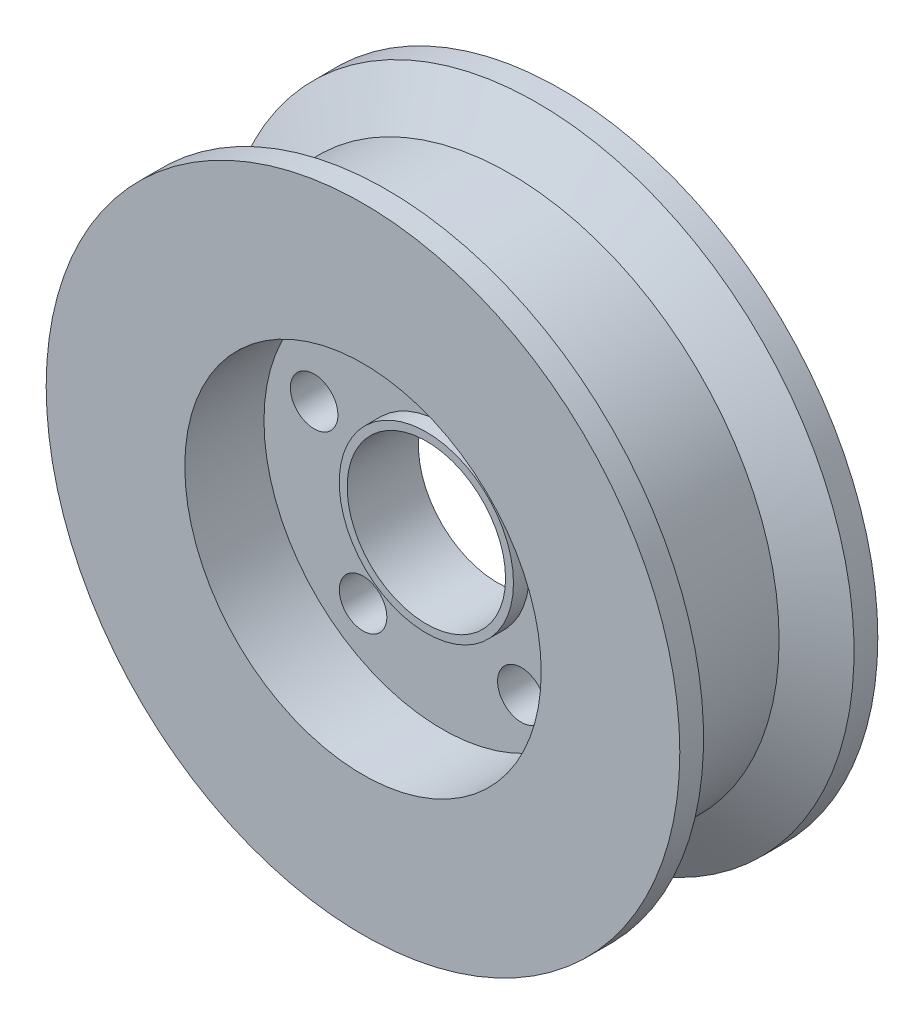
ISO-10303-21;
HEADER;
FILE_DESCRIPTION(('STEP AP214'),'2;1');
FILE_NAME('part.step','',(''),(''),'','','');
FILE_SCHEMA(('AUTOMOTIVE_DESIGN { 1 0 10303 214 1 1 1 1 }'));
ENDSEC;
DATA;
#1=APPLICATION_CONTEXT('core data for automotive mechanical design processes');
#2=APPLICATION_PROTOCOL_DEFINITION('international standard','automotive_design',2000,#1);
#3=PRODUCT_CONTEXT('',#1,'mechanical');
#4=PRODUCT('Part','Part','',(#3));
#5=PRODUCT_RELATED_PRODUCT_CATEGORY('part','',(#4));
#6=PRODUCT_DEFINITION_FORMATION('','',#4);
#7=PRODUCT_DEFINITION_CONTEXT('part definition',#1,'design');
#8=PRODUCT_DEFINITION('design','',#6,#7);
#9=PRODUCT_DEFINITION_SHAPE('','',#8);
#10=(LENGTH_UNIT() NAMED_UNIT(*) SI_UNIT(.MILLI.,.METRE.));
#11=(NAMED_UNIT(*) PLANE_ANGLE_UNIT() SI_UNIT($,.RADIAN.));
#12=(NAMED_UNIT(*) SI_UNIT($,.STERADIAN.) SOLID_ANGLE_UNIT());
#13=UNCERTAINTY_MEASURE_WITH_UNIT(LENGTH_MEASURE(1.E-05),#10,'distance_accuracy_value','');
#14=(GEOMETRIC_REPRESENTATION_CONTEXT(3) GLOBAL_UNCERTAINTY_ASSIGNED_CONTEXT((#13)) GLOBAL_UNIT_ASSIGNED_CONTEXT((#10,
#11,#12)) REPRESENTATION_CONTEXT('',''));
#15=CARTESIAN_POINT('',(0.,0.,0.));
#16=DIRECTION('',(0.,0.,1.));
#17=DIRECTION('',(1.,0.,0.));
#18=AXIS2_PLACEMENT_3D('',#15,#16,#17);
#19=CARTESIAN_POINT('',(0.,0.,12.5));
#20=DIRECTION('',(0.,0.,-1.));
#21=DIRECTION('',(-1.,0.,0.));
#22=AXIS2_PLACEMENT_3D('',#19,#20,#21);
#23=CYLINDRICAL_SURFACE('',#22,40.);
#24=CARTESIAN_POINT('',(0.,0.,-9.5));
#25=DIRECTION('',(0.,0.,-1.));
#26=DIRECTION('',(-1.,0.,0.));
#27=AXIS2_PLACEMENT_3D('',#24,#25,#26);
#28=CIRCLE('',#27,40.);
#29=CARTESIAN_POINT('',(-40.,0.,-9.5));
#30=VERTEX_POINT('',#29);
#31=EDGE_CURVE('E202',#30,#30,#28,.T.);
#32=ORIENTED_EDGE('',*,*,#31,.T.);
#33=EDGE_LOOP('',(#32));
#34=FACE_BOUND('',#33,.T.);
#35=CARTESIAN_POINT('',(0.,0.,-12.5));
#36=DIRECTION('',(0.,0.,1.));
#37=DIRECTION('',(1.,0.,0.));
#38=AXIS2_PLACEMENT_3D('',#35,#36,#37);
#39=CIRCLE('',#38,40.);
#40=CARTESIAN_POINT('',(40.,0.,-12.5));
#41=VERTEX_POINT('',#40);
#42=EDGE_CURVE('E78',#41,#41,#39,.T.);
#43=ORIENTED_EDGE('',*,*,#42,.T.);
#44=EDGE_LOOP('',(#43));
#45=FACE_BOUND('',#44,.T.);
#46=ADVANCED_FACE('F31',(#34,#45),#23,.T.);
#47=CARTESIAN_POINT('',(0.,0.,-12.5));
#48=DIRECTION('',(0.,0.,1.));
#49=DIRECTION('',(1.,0.,0.));
#50=AXIS2_PLACEMENT_3D('',#47,#48,#49);
#51=PLANE('',#50);
#52=ORIENTED_EDGE('',*,*,#42,.F.);
#53=EDGE_LOOP('',(#52));
#54=FACE_BOUND('',#53,.T.);
#55=CARTESIAN_POINT('',(0.,0.,-12.5));
#56=DIRECTION('',(0.,0.,1.));
#57=DIRECTION('',(1.,0.,0.));
#58=AXIS2_PLACEMENT_3D('',#55,#56,#57);
#59=CIRCLE('',#58,22.5);
#60=CARTESIAN_POINT('',(22.5,0.,-12.5));
#61=VERTEX_POINT('',#60);
#62=EDGE_CURVE('E72',#61,#61,#59,.T.);
#63=ORIENTED_EDGE('',*,*,#62,.T.);
#64=EDGE_LOOP('',(#63));
#65=FACE_BOUND('',#64,.T.);
#66=ADVANCED_FACE('F121',(#54,#65),#51,.F.);
#67=CARTESIAN_POINT('',(0.,0.,12.5));
#68=DIRECTION('',(0.,0.,1.));
#69=DIRECTION('',(1.,0.,0.));
#70=AXIS2_PLACEMENT_3D('',#67,#68,#69);
#71=PLANE('',#70);
#72=CARTESIAN_POINT('',(0.,0.,12.5));
#73=DIRECTION('',(0.,0.,1.));
#74=DIRECTION('',(1.,0.,0.));
#75=AXIS2_PLACEMENT_3D('',#72,#73,#74);
#76=CIRCLE('',#75,22.5);
#77=CARTESIAN_POINT('',(22.5,0.,12.5));
#78=VERTEX_POINT('',#77);
#79=EDGE_CURVE('E71',#78,#78,#76,.T.);
#80=ORIENTED_EDGE('',*,*,#79,.F.);
#81=EDGE_LOOP('',(#80));
#82=FACE_BOUND('',#81,.T.);
#83=CARTESIAN_POINT('',(0.,0.,12.5));
#84=DIRECTION('',(0.,0.,1.));
#85=DIRECTION('',(1.,0.,0.));
#86=AXIS2_PLACEMENT_3D('',#83,#84,#85);
#87=CIRCLE('',#86,40.);
#88=CARTESIAN_POINT('',(40.,0.,12.5));
#89=VERTEX_POINT('',#88);
#90=EDGE_CURVE('E43',#89,#89,#87,.T.);
#91=ORIENTED_EDGE('',*,*,#90,.T.);
#92=EDGE_LOOP('',(#91));
#93=FACE_BOUND('',#92,.T.);
#94=ADVANCED_FACE('F123',(#82,#93),#71,.T.);
#95=CARTESIAN_POINT('',(0.,0.,9.5));
#96=DIRECTION('',(0.,0.,-1.));
#97=DIRECTION('',(-1.,0.,0.));
#98=AXIS2_PLACEMENT_3D('',#95,#96,#97);
#99=CIRCLE('',#98,40.);
#100=CARTESIAN_POINT('',(-40.,0.,9.5));
#101=VERTEX_POINT('',#100);
#102=EDGE_CURVE('E194',#101,#101,#99,.T.);
#103=ORIENTED_EDGE('',*,*,#102,.F.);
#104=EDGE_LOOP('',(#103));
#105=FACE_BOUND('',#104,.T.);
#106=ORIENTED_EDGE('',*,*,#90,.F.);
#107=EDGE_LOOP('',(#106));
#108=FACE_BOUND('',#107,.T.);
#109=ADVANCED_FACE('F33',(#105,#108),#23,.T.);
#110=CARTESIAN_POINT('',(0.,0.,2.5));
#111=DIRECTION('',(0.,0.,1.));
#112=DIRECTION('',(1.,0.,0.));
#113=AXIS2_PLACEMENT_3D('',#110,#111,#112);
#114=CYLINDRICAL_SURFACE('',#113,22.5);
#115=CARTESIAN_POINT('',(0.,0.,2.5));
#116=DIRECTION('',(0.,0.,1.));
#117=DIRECTION('',(1.,0.,0.));
#118=AXIS2_PLACEMENT_3D('',#115,#116,#117);
#119=CIRCLE('',#118,22.5);
#120=CARTESIAN_POINT('',(22.5,0.,2.5));
#121=VERTEX_POINT('',#120);
#122=EDGE_CURVE('E75',#121,#121,#119,.T.);
#123=ORIENTED_EDGE('',*,*,#122,.F.);
#124=EDGE_LOOP('',(#123));
#125=FACE_BOUND('',#124,.T.);
#126=ORIENTED_EDGE('',*,*,#79,.T.);
#127=EDGE_LOOP('',(#126));
#128=FACE_BOUND('',#127,.T.);
#129=ADVANCED_FACE('F140',(#125,#128),#114,.F.);
#130=CARTESIAN_POINT('',(0.,0.,2.5));
#131=DIRECTION('',(0.,0.,1.));
#132=DIRECTION('',(1.,0.,0.));
#133=AXIS2_PLACEMENT_3D('',#130,#131,#132);
#134=PLANE('',#133);
#135=CARTESIAN_POINT('',(0.,0.,2.5));
#136=DIRECTION('',(0.,0.,1.));
#137=DIRECTION('',(1.,0.,0.));
#138=AXIS2_PLACEMENT_3D('',#135,#136,#137);
#139=CIRCLE('',#138,11.);
#140=CARTESIAN_POINT('',(11.,0.,2.5));
#141=VERTEX_POINT('',#140);
#142=EDGE_CURVE('E10',#141,#141,#139,.T.);
#143=ORIENTED_EDGE('',*,*,#142,.F.);
#144=EDGE_LOOP('',(#143));
#145=FACE_BOUND('',#144,.T.);
#146=CARTESIAN_POINT('',(-16.1679607770176,5.25328890437429,2.5));
#147=DIRECTION('',(0.,0.,1.));
#148=DIRECTION('',(0.309016994374958,0.95105651629515,0.));
#149=AXIS2_PLACEMENT_3D('',#146,#147,#148);
#150=CIRCLE('',#149,3.);
#151=CARTESIAN_POINT('',(-15.2409097938927,8.10645845325974,2.5));
#152=VERTEX_POINT('',#151);
#153=EDGE_CURVE('E48',#152,#152,#150,.T.);
#154=ORIENTED_EDGE('',*,*,#153,.F.);
#155=EDGE_LOOP('',(#154));
#156=FACE_BOUND('',#155,.T.);
#157=CARTESIAN_POINT('',(-9.99234928897216,-13.753288904374,2.5));
#158=DIRECTION('',(0.,0.,1.));
#159=DIRECTION('',(-0.809016994374942,0.58778525229248,0.));
#160=AXIS2_PLACEMENT_3D('',#157,#158,#159);
#161=CIRCLE('',#160,3.);
#162=CARTESIAN_POINT('',(-12.419400272097,-11.9899331474966,2.5));
#163=VERTEX_POINT('',#162);
#164=EDGE_CURVE('E52',#163,#163,#161,.T.);
#165=ORIENTED_EDGE('',*,*,#164,.F.);
#166=EDGE_LOOP('',(#165));
#167=FACE_BOUND('',#166,.T.);
#168=CARTESIAN_POINT('',(9.99234928897197,-13.7532889043742,2.5));
#169=DIRECTION('',(0.,0.,1.));
#170=DIRECTION('',(-0.809016994374951,-0.587785252292469,0.));
#171=AXIS2_PLACEMENT_3D('',#168,#169,#170);
#172=CIRCLE('',#171,3.);
#173=CARTESIAN_POINT('',(7.56529830584712,-15.5166446612516,2.5));
#174=VERTEX_POINT('',#173);
#175=EDGE_CURVE('E56',#174,#174,#172,.T.);
#176=ORIENTED_EDGE('',*,*,#175,.F.);
#177=EDGE_LOOP('',(#176));
#178=FACE_BOUND('',#177,.T.);
#179=CARTESIAN_POINT('',(16.1679607770176,5.25328890437406,2.5));
#180=DIRECTION('',(0.,0.,1.));
#181=DIRECTION('',(0.309016994374945,-0.951056516295155,0.));
#182=AXIS2_PLACEMENT_3D('',#179,#180,#181);
#183=CIRCLE('',#182,3.);
#184=CARTESIAN_POINT('',(17.0950117601425,2.4001193554886,2.5));
#185=VERTEX_POINT('',#184);
#186=EDGE_CURVE('E60',#185,#185,#183,.T.);
#187=ORIENTED_EDGE('',*,*,#186,.F.);
#188=EDGE_LOOP('',(#187));
#189=FACE_BOUND('',#188,.T.);
#190=CARTESIAN_POINT('',(0.,17.,2.5));
#191=DIRECTION('',(0.,0.,1.));
#192=DIRECTION('',(1.,0.,0.));
#193=AXIS2_PLACEMENT_3D('',#190,#191,#192);
#194=CIRCLE('',#193,3.);
#195=CARTESIAN_POINT('',(3.,17.,2.5));
#196=VERTEX_POINT('',#195);
#197=EDGE_CURVE('E64',#196,#196,#194,.T.);
#198=ORIENTED_EDGE('',*,*,#197,.F.);
#199=EDGE_LOOP('',(#198));
#200=FACE_BOUND('',#199,.T.);
#201=ORIENTED_EDGE('',*,*,#122,.T.);
#202=EDGE_LOOP('',(#201));
#203=FACE_BOUND('',#202,.T.);
#204=ADVANCED_FACE('F117',(#145,#156,#167,#178,#189,#200,#203),#134,.T.);
#205=CARTESIAN_POINT('',(0.,0.,-2.5));
#206=DIRECTION('',(0.,0.,-1.));
#207=DIRECTION('',(-1.,0.,0.));
#208=AXIS2_PLACEMENT_3D('',#205,#206,#207);
#209=CYLINDRICAL_SURFACE('',#208,22.5);
#210=CARTESIAN_POINT('',(0.,0.,-2.5));
#211=DIRECTION('',(0.,0.,1.));
#212=DIRECTION('',(1.,0.,0.));
#213=AXIS2_PLACEMENT_3D('',#210,#211,#212);
#214=CIRCLE('',#213,22.5);
#215=CARTESIAN_POINT('',(22.5,0.,-2.5));
#216=VERTEX_POINT('',#215);
#217=EDGE_CURVE('E68',#216,#216,#214,.T.);
#218=ORIENTED_EDGE('',*,*,#217,.T.);
#219=EDGE_LOOP('',(#218));
#220=FACE_BOUND('',#219,.T.);
#221=ORIENTED_EDGE('',*,*,#62,.F.);
#222=EDGE_LOOP('',(#221));
#223=FACE_BOUND('',#222,.T.);
#224=ADVANCED_FACE('F102',(#220,#223),#209,.F.);
#225=CARTESIAN_POINT('',(0.,0.,-2.5));
#226=DIRECTION('',(0.,0.,-1.));
#227=DIRECTION('',(1.,0.,0.));
#228=AXIS2_PLACEMENT_3D('',#225,#226,#227);
#229=PLANE('',#228);
#230=CARTESIAN_POINT('',(0.,0.,-2.5));
#231=DIRECTION('',(0.,0.,-1.));
#232=DIRECTION('',(-1.,0.,0.));
#233=AXIS2_PLACEMENT_3D('',#230,#231,#232);
#234=CIRCLE('',#233,11.);
#235=CARTESIAN_POINT('',(-11.,0.,-2.5));
#236=VERTEX_POINT('',#235);
#237=EDGE_CURVE('E35',#236,#236,#234,.T.);
#238=ORIENTED_EDGE('',*,*,#237,.F.);
#239=EDGE_LOOP('',(#238));
#240=FACE_BOUND('',#239,.T.);
#241=CARTESIAN_POINT('',(-16.1679607770176,5.25328890437429,-2.5));
#242=DIRECTION('',(0.,0.,-1.));
#243=DIRECTION('',(-1.,0.,0.));
#244=AXIS2_PLACEMENT_3D('',#241,#242,#243);
#245=CIRCLE('',#244,3.);
#246=CARTESIAN_POINT('',(-19.1679607770176,5.25328890437429,-2.5));
#247=VERTEX_POINT('',#246);
#248=EDGE_CURVE('E51',#247,#247,#245,.T.);
#249=ORIENTED_EDGE('',*,*,#248,.F.);
#250=EDGE_LOOP('',(#249));
#251=FACE_BOUND('',#250,.T.);
#252=CARTESIAN_POINT('',(-9.99234928897216,-13.753288904374,-2.5));
#253=DIRECTION('',(0.,0.,-1.));
#254=DIRECTION('',(-1.,0.,0.));
#255=AXIS2_PLACEMENT_3D('',#252,#253,#254);
#256=CIRCLE('',#255,3.);
#257=CARTESIAN_POINT('',(-12.9923492889722,-13.753288904374,-2.5));
#258=VERTEX_POINT('',#257);
#259=EDGE_CURVE('E55',#258,#258,#256,.T.);
#260=ORIENTED_EDGE('',*,*,#259,.F.);
#261=EDGE_LOOP('',(#260));
#262=FACE_BOUND('',#261,.T.);
#263=CARTESIAN_POINT('',(9.99234928897197,-13.7532889043742,-2.5));
#264=DIRECTION('',(0.,0.,-1.));
#265=DIRECTION('',(-1.,0.,0.));
#266=AXIS2_PLACEMENT_3D('',#263,#264,#265);
#267=CIRCLE('',#266,3.);
#268=CARTESIAN_POINT('',(6.99234928897197,-13.7532889043742,-2.5));
#269=VERTEX_POINT('',#268);
#270=EDGE_CURVE('E59',#269,#269,#267,.T.);
#271=ORIENTED_EDGE('',*,*,#270,.F.);
#272=EDGE_LOOP('',(#271));
#273=FACE_BOUND('',#272,.T.);
#274=CARTESIAN_POINT('',(16.1679607770176,5.25328890437406,-2.5));
#275=DIRECTION('',(0.,0.,-1.));
#276=DIRECTION('',(-1.,0.,0.));
#277=AXIS2_PLACEMENT_3D('',#274,#275,#276);
#278=CIRCLE('',#277,3.);
#279=CARTESIAN_POINT('',(13.1679607770176,5.25328890437406,-2.5));
#280=VERTEX_POINT('',#279);
#281=EDGE_CURVE('E63',#280,#280,#278,.T.);
#282=ORIENTED_EDGE('',*,*,#281,.F.);
#283=EDGE_LOOP('',(#282));
#284=FACE_BOUND('',#283,.T.);
#285=CARTESIAN_POINT('',(0.,17.,-2.5));
#286=DIRECTION('',(0.,0.,-1.));
#287=DIRECTION('',(-1.,0.,0.));
#288=AXIS2_PLACEMENT_3D('',#285,#286,#287);
#289=CIRCLE('',#288,3.);
#290=CARTESIAN_POINT('',(-3.,17.,-2.5));
#291=VERTEX_POINT('',#290);
#292=EDGE_CURVE('E67',#291,#291,#289,.T.);
#293=ORIENTED_EDGE('',*,*,#292,.F.);
#294=EDGE_LOOP('',(#293));
#295=FACE_BOUND('',#294,.T.);
#296=ORIENTED_EDGE('',*,*,#217,.F.);
#297=EDGE_LOOP('',(#296));
#298=FACE_BOUND('',#297,.T.);
#299=ADVANCED_FACE('F98',(#240,#251,#262,#273,#284,#295,#298),#229,.T.);
#300=CARTESIAN_POINT('',(0.,17.,-12.5));
#301=DIRECTION('',(0.,0.,1.));
#302=DIRECTION('',(1.,0.,0.));
#303=AXIS2_PLACEMENT_3D('',#300,#301,#302);
#304=CYLINDRICAL_SURFACE('',#303,3.);
#305=ORIENTED_EDGE('',*,*,#292,.T.);
#306=EDGE_LOOP('',(#305));
#307=FACE_BOUND('',#306,.T.);
#308=ORIENTED_EDGE('',*,*,#197,.T.);
#309=EDGE_LOOP('',(#308));
#310=FACE_BOUND('',#309,.T.);
#311=ADVANCED_FACE('F101',(#307,#310),#304,.F.);
#312=CARTESIAN_POINT('',(16.1679607770176,5.25328890437406,-12.5));
#313=DIRECTION('',(0.,0.,1.));
#314=DIRECTION('',(1.,0.,0.));
#315=AXIS2_PLACEMENT_3D('',#312,#313,#314);
#316=CYLINDRICAL_SURFACE('',#315,3.);
#317=ORIENTED_EDGE('',*,*,#281,.T.);
#318=EDGE_LOOP('',(#317));
#319=FACE_BOUND('',#318,.T.);
#320=ORIENTED_EDGE('',*,*,#186,.T.);
#321=EDGE_LOOP('',(#320));
#322=FACE_BOUND('',#321,.T.);
#323=ADVANCED_FACE('F149',(#319,#322),#316,.F.);
#324=CARTESIAN_POINT('',(9.99234928897197,-13.7532889043742,-12.5));
#325=DIRECTION('',(0.,0.,1.));
#326=DIRECTION('',(1.,0.,0.));
#327=AXIS2_PLACEMENT_3D('',#324,#325,#326);
#328=CYLINDRICAL_SURFACE('',#327,3.);
#329=ORIENTED_EDGE('',*,*,#270,.T.);
#330=EDGE_LOOP('',(#329));
#331=FACE_BOUND('',#330,.T.);
#332=ORIENTED_EDGE('',*,*,#175,.T.);
#333=EDGE_LOOP('',(#332));
#334=FACE_BOUND('',#333,.T.);
#335=ADVANCED_FACE('F153',(#331,#334),#328,.F.);
#336=CARTESIAN_POINT('',(-9.99234928897216,-13.753288904374,-12.5));
#337=DIRECTION('',(0.,0.,1.));
#338=DIRECTION('',(1.,0.,0.));
#339=AXIS2_PLACEMENT_3D('',#336,#337,#338);
#340=CYLINDRICAL_SURFACE('',#339,3.);
#341=ORIENTED_EDGE('',*,*,#259,.T.);
#342=EDGE_LOOP('',(#341));
#343=FACE_BOUND('',#342,.T.);
#344=ORIENTED_EDGE('',*,*,#164,.T.);
#345=EDGE_LOOP('',(#344));
#346=FACE_BOUND('',#345,.T.);
#347=ADVANCED_FACE('F157',(#343,#346),#340,.F.);
#348=CARTESIAN_POINT('',(-16.1679607770176,5.25328890437429,-12.5));
#349=DIRECTION('',(0.,0.,1.));
#350=DIRECTION('',(1.,0.,0.));
#351=AXIS2_PLACEMENT_3D('',#348,#349,#350);
#352=CYLINDRICAL_SURFACE('',#351,3.);
#353=ORIENTED_EDGE('',*,*,#248,.T.);
#354=EDGE_LOOP('',(#353));
#355=FACE_BOUND('',#354,.T.);
#356=ORIENTED_EDGE('',*,*,#153,.T.);
#357=EDGE_LOOP('',(#356));
#358=FACE_BOUND('',#357,.T.);
#359=ADVANCED_FACE('F95',(#355,#358),#352,.F.);
#360=CARTESIAN_POINT('',(0.,0.,-4.5));
#361=DIRECTION('',(0.,0.,1.));
#362=DIRECTION('',(1.,0.,0.));
#363=AXIS2_PLACEMENT_3D('',#360,#361,#362);
#364=CYLINDRICAL_SURFACE('',#363,11.);
#365=ORIENTED_EDGE('',*,*,#237,.T.);
#366=EDGE_LOOP('',(#365));
#367=FACE_BOUND('',#366,.T.);
#368=CARTESIAN_POINT('',(0.,0.,-4.5));
#369=DIRECTION('',(0.,0.,1.));
#370=DIRECTION('',(1.,0.,0.));
#371=AXIS2_PLACEMENT_3D('',#368,#369,#370);
#372=CIRCLE('',#371,11.);
#373=CARTESIAN_POINT('',(11.,0.,-4.5));
#374=VERTEX_POINT('',#373);
#375=EDGE_CURVE('E46',#374,#374,#372,.T.);
#376=ORIENTED_EDGE('',*,*,#375,.T.);
#377=EDGE_LOOP('',(#376));
#378=FACE_BOUND('',#377,.T.);
#379=ADVANCED_FACE('F164',(#367,#378),#364,.T.);
#380=CARTESIAN_POINT('',(0.,0.,-4.5));
#381=DIRECTION('',(0.,0.,1.));
#382=DIRECTION('',(1.,0.,0.));
#383=AXIS2_PLACEMENT_3D('',#380,#381,#382);
#384=PLANE('',#383);
#385=CARTESIAN_POINT('',(0.,0.,-4.5));
#386=DIRECTION('',(0.,0.,1.));
#387=DIRECTION('',(1.,0.,0.));
#388=AXIS2_PLACEMENT_3D('',#385,#386,#387);
#389=CIRCLE('',#388,10.);
#390=CARTESIAN_POINT('',(10.,0.,-4.5));
#391=VERTEX_POINT('',#390);
#392=EDGE_CURVE('E210',#391,#391,#389,.T.);
#393=ORIENTED_EDGE('',*,*,#392,.T.);
#394=EDGE_LOOP('',(#393));
#395=FACE_BOUND('',#394,.T.);
#396=ORIENTED_EDGE('',*,*,#375,.F.);
#397=EDGE_LOOP('',(#396));
#398=FACE_BOUND('',#397,.T.);
#399=ADVANCED_FACE('F167',(#395,#398),#384,.F.);
#400=ORIENTED_EDGE('',*,*,#142,.T.);
#401=EDGE_LOOP('',(#400));
#402=FACE_BOUND('',#401,.T.);
#403=CARTESIAN_POINT('',(0.,0.,4.5));
#404=DIRECTION('',(0.,0.,1.));
#405=DIRECTION('',(1.,0.,0.));
#406=AXIS2_PLACEMENT_3D('',#403,#404,#405);
#407=CIRCLE('',#406,11.);
#408=CARTESIAN_POINT('',(11.,0.,4.5));
#409=VERTEX_POINT('',#408);
#410=EDGE_CURVE('E208',#409,#409,#407,.T.);
#411=ORIENTED_EDGE('',*,*,#410,.F.);
#412=EDGE_LOOP('',(#411));
#413=FACE_BOUND('',#412,.T.);
#414=ADVANCED_FACE('F169',(#402,#413),#364,.T.);
#415=CARTESIAN_POINT('',(0.,0.,4.5));
#416=DIRECTION('',(0.,0.,1.));
#417=DIRECTION('',(1.,0.,0.));
#418=AXIS2_PLACEMENT_3D('',#415,#416,#417);
#419=PLANE('',#418);
#420=ORIENTED_EDGE('',*,*,#410,.T.);
#421=EDGE_LOOP('',(#420));
#422=FACE_BOUND('',#421,.T.);
#423=CARTESIAN_POINT('',(0.,0.,4.5));
#424=DIRECTION('',(0.,0.,1.));
#425=DIRECTION('',(1.,0.,0.));
#426=AXIS2_PLACEMENT_3D('',#423,#424,#425);
#427=CIRCLE('',#426,10.);
#428=CARTESIAN_POINT('',(10.,0.,4.5));
#429=VERTEX_POINT('',#428);
#430=EDGE_CURVE('E205',#429,#429,#427,.T.);
#431=ORIENTED_EDGE('',*,*,#430,.F.);
#432=EDGE_LOOP('',(#431));
#433=FACE_BOUND('',#432,.T.);
#434=ADVANCED_FACE('F138',(#422,#433),#419,.T.);
#435=CARTESIAN_POINT('',(0.,0.,12.5));
#436=DIRECTION('',(0.,0.,-1.));
#437=DIRECTION('',(-1.,0.,0.));
#438=AXIS2_PLACEMENT_3D('',#435,#436,#437);
#439=CYLINDRICAL_SURFACE('',#438,10.);
#440=ORIENTED_EDGE('',*,*,#392,.F.);
#441=EDGE_LOOP('',(#440));
#442=FACE_BOUND('',#441,.T.);
#443=ORIENTED_EDGE('',*,*,#430,.T.);
#444=EDGE_LOOP('',(#443));
#445=FACE_BOUND('',#444,.T.);
#446=ADVANCED_FACE('F134',(#442,#445),#439,.F.);
#447=CARTESIAN_POINT('',(0.,0.,-6.03589838486221));
#448=DIRECTION('',(0.,0.,-1.));
#449=DIRECTION('',(-1.,0.,0.));
#450=AXIS2_PLACEMENT_3D('',#447,#448,#449);
#451=CONICAL_SURFACE('',#450,34.,1.04719755119659);
#452=ORIENTED_EDGE('',*,*,#31,.F.);
#453=EDGE_LOOP('',(#452));
#454=FACE_BOUND('',#453,.T.);
#455=CARTESIAN_POINT('',(0.,0.,-6.03589838486221));
#456=DIRECTION('',(0.,0.,-1.));
#457=DIRECTION('',(-1.,0.,0.));
#458=AXIS2_PLACEMENT_3D('',#455,#456,#457);
#459=CIRCLE('',#458,34.);
#460=CARTESIAN_POINT('',(-34.,0.,-6.03589838486221));
#461=VERTEX_POINT('',#460);
#462=EDGE_CURVE('E197',#461,#461,#459,.T.);
#463=ORIENTED_EDGE('',*,*,#462,.T.);
#464=EDGE_LOOP('',(#463));
#465=FACE_BOUND('',#464,.T.);
#466=ADVANCED_FACE('F137',(#454,#465),#451,.T.);
#467=CARTESIAN_POINT('',(0.,0.,-24.4057774427653));
#468=DIRECTION('',(0.,0.,-1.));
#469=DIRECTION('',(-1.,0.,0.));
#470=AXIS2_PLACEMENT_3D('',#467,#468,#469);
#471=CYLINDRICAL_SURFACE('',#470,34.);
#472=ORIENTED_EDGE('',*,*,#462,.F.);
#473=EDGE_LOOP('',(#472));
#474=FACE_BOUND('',#473,.T.);
#475=CARTESIAN_POINT('',(0.,0.,6.03589838486221));
#476=DIRECTION('',(0.,0.,-1.));
#477=DIRECTION('',(-1.,0.,0.));
#478=AXIS2_PLACEMENT_3D('',#475,#476,#477);
#479=CIRCLE('',#478,34.);
#480=CARTESIAN_POINT('',(-34.,0.,6.03589838486221));
#481=VERTEX_POINT('',#480);
#482=EDGE_CURVE('E191',#481,#481,#479,.T.);
#483=ORIENTED_EDGE('',*,*,#482,.T.);
#484=EDGE_LOOP('',(#483));
#485=FACE_BOUND('',#484,.T.);
#486=ADVANCED_FACE('F178',(#474,#485),#471,.T.);
#487=CARTESIAN_POINT('',(0.,0.,9.5));
#488=DIRECTION('',(0.,0.,1.));
#489=DIRECTION('',(1.,0.,0.));
#490=AXIS2_PLACEMENT_3D('',#487,#488,#489);
#491=CONICAL_SURFACE('',#490,40.,1.04719755119659);
#492=ORIENTED_EDGE('',*,*,#482,.F.);
#493=EDGE_LOOP('',(#492));
#494=FACE_BOUND('',#493,.T.);
#495=ORIENTED_EDGE('',*,*,#102,.T.);
#496=EDGE_LOOP('',(#495));
#497=FACE_BOUND('',#496,.T.);
#498=ADVANCED_FACE('F182',(#494,#497),#491,.T.);
#499=CLOSED_SHELL('',(#46,#66,#94,#109,#129,#204,#224,#299,#311,#323,#335,#347,#359,#379,#399,
#414,#434,#446,#466,#486,#498));
#500=MANIFOLD_SOLID_BREP('B2',#499);
#501=ADVANCED_BREP_SHAPE_REPRESENTATION('',(#18,#500),#14);
#502=SHAPE_DEFINITION_REPRESENTATION(#9,#501);
ENDSEC;
END-ISO-10303-21;
